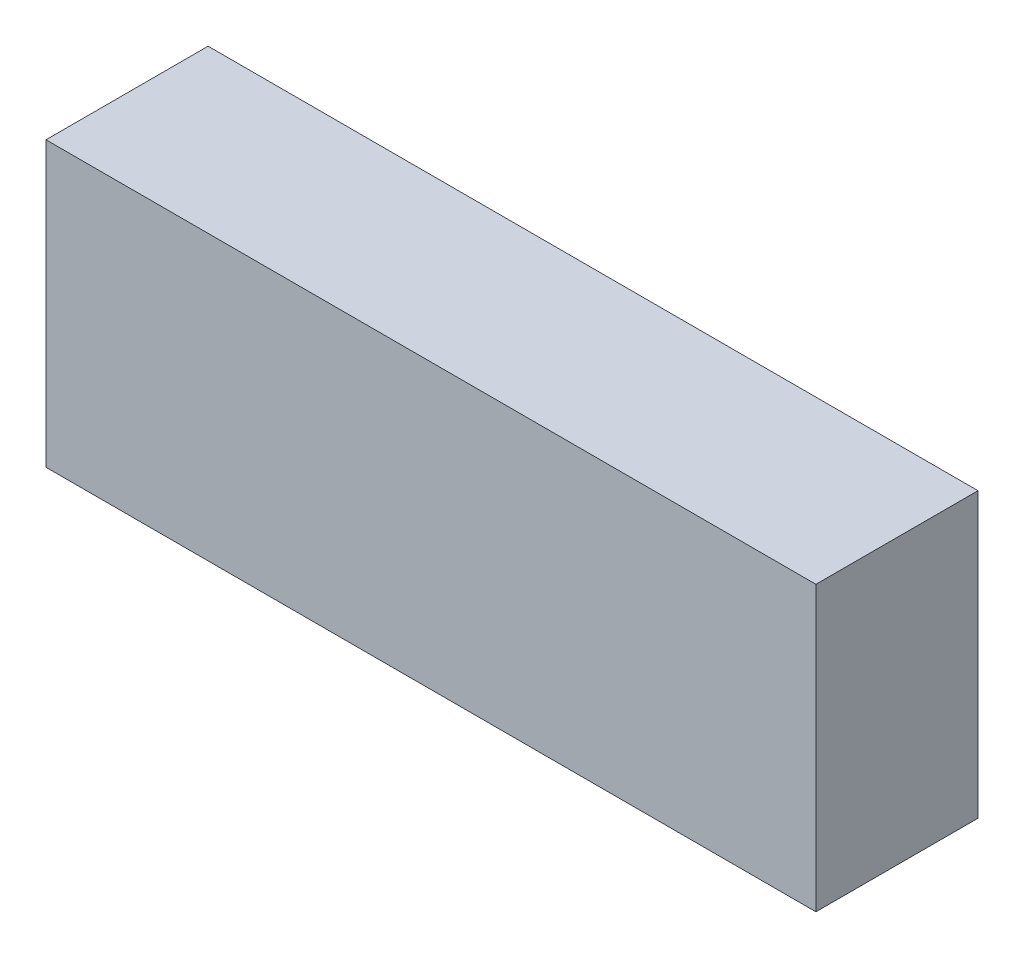
ISO-10303-21;
HEADER;
FILE_DESCRIPTION(('STEP AP214'),'2;1');
FILE_NAME('part.step','',(''),(''),'','','');
FILE_SCHEMA(('AUTOMOTIVE_DESIGN { 1 0 10303 214 1 1 1 1 }'));
ENDSEC;
DATA;
#1=APPLICATION_CONTEXT('core data for automotive mechanical design processes');
#2=APPLICATION_PROTOCOL_DEFINITION('international standard','automotive_design',2000,#1);
#3=PRODUCT_CONTEXT('',#1,'mechanical');
#4=PRODUCT('Part','Part','',(#3));
#5=PRODUCT_RELATED_PRODUCT_CATEGORY('part','',(#4));
#6=PRODUCT_DEFINITION_FORMATION('','',#4);
#7=PRODUCT_DEFINITION_CONTEXT('part definition',#1,'design');
#8=PRODUCT_DEFINITION('design','',#6,#7);
#9=PRODUCT_DEFINITION_SHAPE('','',#8);
#10=(LENGTH_UNIT() NAMED_UNIT(*) SI_UNIT(.MILLI.,.METRE.));
#11=(NAMED_UNIT(*) PLANE_ANGLE_UNIT() SI_UNIT($,.RADIAN.));
#12=(NAMED_UNIT(*) SI_UNIT($,.STERADIAN.) SOLID_ANGLE_UNIT());
#13=UNCERTAINTY_MEASURE_WITH_UNIT(LENGTH_MEASURE(1.E-05),#10,'distance_accuracy_value','');
#14=(GEOMETRIC_REPRESENTATION_CONTEXT(3) GLOBAL_UNCERTAINTY_ASSIGNED_CONTEXT((#13)) GLOBAL_UNIT_ASSIGNED_CONTEXT((#10,
#11,#12)) REPRESENTATION_CONTEXT('',''));
#15=CARTESIAN_POINT('',(0.,0.,0.));
#16=DIRECTION('',(0.,0.,1.));
#17=DIRECTION('',(1.,0.,0.));
#18=AXIS2_PLACEMENT_3D('',#15,#16,#17);
#19=CARTESIAN_POINT('',(19.,-7.,8.));
#20=DIRECTION('',(-1.,0.,0.));
#21=DIRECTION('',(0.,0.,1.));
#22=AXIS2_PLACEMENT_3D('',#19,#20,#21);
#23=PLANE('',#22);
#24=DIRECTION('',(0.,1.,0.));
#25=VECTOR('',#24,1.);
#26=CARTESIAN_POINT('',(19.,-7.,0.));
#27=LINE('',#26,#25);
#28=CARTESIAN_POINT('',(19.,-7.,0.));
#29=VERTEX_POINT('',#28);
#30=CARTESIAN_POINT('',(19.,7.,0.));
#31=VERTEX_POINT('',#30);
#32=EDGE_CURVE('E97',#29,#31,#27,.T.);
#33=ORIENTED_EDGE('',*,*,#32,.T.);
#34=DIRECTION('',(0.,0.,-1.));
#35=VECTOR('',#34,1.);
#36=CARTESIAN_POINT('',(19.,7.,8.));
#37=LINE('',#36,#35);
#38=CARTESIAN_POINT('',(19.,7.,8.));
#39=VERTEX_POINT('',#38);
#40=EDGE_CURVE('E11',#39,#31,#37,.T.);
#41=ORIENTED_EDGE('',*,*,#40,.F.);
#42=DIRECTION('',(0.,1.,0.));
#43=VECTOR('',#42,1.);
#44=CARTESIAN_POINT('',(19.,-7.,8.));
#45=LINE('',#44,#43);
#46=CARTESIAN_POINT('',(19.,-7.,8.));
#47=VERTEX_POINT('',#46);
#48=EDGE_CURVE('E85',#47,#39,#45,.T.);
#49=ORIENTED_EDGE('',*,*,#48,.F.);
#50=DIRECTION('',(0.,0.,-1.));
#51=VECTOR('',#50,1.);
#52=CARTESIAN_POINT('',(19.,-7.,8.));
#53=LINE('',#52,#51);
#54=EDGE_CURVE('E93',#47,#29,#53,.T.);
#55=ORIENTED_EDGE('',*,*,#54,.T.);
#56=EDGE_LOOP('',(#33,#41,#49,#55));
#57=FACE_BOUND('',#56,.T.);
#58=ADVANCED_FACE('F34',(#57),#23,.F.);
#59=CARTESIAN_POINT('',(-19.,7.,8.));
#60=DIRECTION('',(0.,-1.,0.));
#61=DIRECTION('',(0.,0.,-1.));
#62=AXIS2_PLACEMENT_3D('',#59,#60,#61);
#63=PLANE('',#62);
#64=DIRECTION('',(-1.,0.,0.));
#65=VECTOR('',#64,1.);
#66=CARTESIAN_POINT('',(-19.,7.,0.));
#67=LINE('',#66,#65);
#68=CARTESIAN_POINT('',(-19.,7.,0.));
#69=VERTEX_POINT('',#68);
#70=EDGE_CURVE('E89',#31,#69,#67,.T.);
#71=ORIENTED_EDGE('',*,*,#70,.T.);
#72=DIRECTION('',(0.,0.,-1.));
#73=VECTOR('',#72,1.);
#74=CARTESIAN_POINT('',(-19.,7.,8.));
#75=LINE('',#74,#73);
#76=CARTESIAN_POINT('',(-19.,7.,8.));
#77=VERTEX_POINT('',#76);
#78=EDGE_CURVE('E42',#77,#69,#75,.T.);
#79=ORIENTED_EDGE('',*,*,#78,.F.);
#80=DIRECTION('',(-1.,0.,0.));
#81=VECTOR('',#80,1.);
#82=CARTESIAN_POINT('',(-19.,7.,8.));
#83=LINE('',#82,#81);
#84=EDGE_CURVE('E80',#39,#77,#83,.T.);
#85=ORIENTED_EDGE('',*,*,#84,.F.);
#86=ORIENTED_EDGE('',*,*,#40,.T.);
#87=EDGE_LOOP('',(#71,#79,#85,#86));
#88=FACE_BOUND('',#87,.T.);
#89=ADVANCED_FACE('F88',(#88),#63,.F.);
#90=CARTESIAN_POINT('',(-19.,-7.,8.));
#91=DIRECTION('',(1.,0.,0.));
#92=DIRECTION('',(0.,0.,-1.));
#93=AXIS2_PLACEMENT_3D('',#90,#91,#92);
#94=PLANE('',#93);
#95=DIRECTION('',(0.,-1.,0.));
#96=VECTOR('',#95,1.);
#97=CARTESIAN_POINT('',(-19.,-7.,0.));
#98=LINE('',#97,#96);
#99=CARTESIAN_POINT('',(-19.,-7.,0.));
#100=VERTEX_POINT('',#99);
#101=EDGE_CURVE('E67',#69,#100,#98,.T.);
#102=ORIENTED_EDGE('',*,*,#101,.T.);
#103=DIRECTION('',(0.,0.,-1.));
#104=VECTOR('',#103,1.);
#105=CARTESIAN_POINT('',(-19.,-7.,8.));
#106=LINE('',#105,#104);
#107=CARTESIAN_POINT('',(-19.,-7.,8.));
#108=VERTEX_POINT('',#107);
#109=EDGE_CURVE('E90',#108,#100,#106,.T.);
#110=ORIENTED_EDGE('',*,*,#109,.F.);
#111=DIRECTION('',(0.,-1.,0.));
#112=VECTOR('',#111,1.);
#113=CARTESIAN_POINT('',(-19.,-7.,8.));
#114=LINE('',#113,#112);
#115=EDGE_CURVE('E83',#77,#108,#114,.T.);
#116=ORIENTED_EDGE('',*,*,#115,.F.);
#117=ORIENTED_EDGE('',*,*,#78,.T.);
#118=EDGE_LOOP('',(#102,#110,#116,#117));
#119=FACE_BOUND('',#118,.T.);
#120=ADVANCED_FACE('F91',(#119),#94,.F.);
#121=CARTESIAN_POINT('',(-19.,-7.,8.));
#122=DIRECTION('',(0.,1.,0.));
#123=DIRECTION('',(0.,0.,1.));
#124=AXIS2_PLACEMENT_3D('',#121,#122,#123);
#125=PLANE('',#124);
#126=DIRECTION('',(1.,0.,0.));
#127=VECTOR('',#126,1.);
#128=CARTESIAN_POINT('',(-19.,-7.,0.));
#129=LINE('',#128,#127);
#130=EDGE_CURVE('E73',#100,#29,#129,.T.);
#131=ORIENTED_EDGE('',*,*,#130,.T.);
#132=ORIENTED_EDGE('',*,*,#54,.F.);
#133=DIRECTION('',(1.,0.,0.));
#134=VECTOR('',#133,1.);
#135=CARTESIAN_POINT('',(-19.,-7.,8.));
#136=LINE('',#135,#134);
#137=EDGE_CURVE('E50',#108,#47,#136,.T.);
#138=ORIENTED_EDGE('',*,*,#137,.F.);
#139=ORIENTED_EDGE('',*,*,#109,.T.);
#140=EDGE_LOOP('',(#131,#132,#138,#139));
#141=FACE_BOUND('',#140,.T.);
#142=ADVANCED_FACE('F104',(#141),#125,.F.);
#143=CARTESIAN_POINT('',(0.,0.,8.));
#144=DIRECTION('',(0.,0.,-1.));
#145=DIRECTION('',(-1.,0.,0.));
#146=AXIS2_PLACEMENT_3D('',#143,#144,#145);
#147=PLANE('',#146);
#148=ORIENTED_EDGE('',*,*,#48,.T.);
#149=ORIENTED_EDGE('',*,*,#84,.T.);
#150=ORIENTED_EDGE('',*,*,#115,.T.);
#151=ORIENTED_EDGE('',*,*,#137,.T.);
#152=EDGE_LOOP('',(#148,#149,#150,#151));
#153=FACE_BOUND('',#152,.T.);
#154=ADVANCED_FACE('F81',(#153),#147,.F.);
#155=CARTESIAN_POINT('',(0.,0.,0.));
#156=DIRECTION('',(0.,0.,-1.));
#157=DIRECTION('',(-1.,0.,0.));
#158=AXIS2_PLACEMENT_3D('',#155,#156,#157);
#159=PLANE('',#158);
#160=ORIENTED_EDGE('',*,*,#32,.F.);
#161=ORIENTED_EDGE('',*,*,#130,.F.);
#162=ORIENTED_EDGE('',*,*,#101,.F.);
#163=ORIENTED_EDGE('',*,*,#70,.F.);
#164=EDGE_LOOP('',(#160,#161,#162,#163));
#165=FACE_BOUND('',#164,.T.);
#166=ADVANCED_FACE('F107',(#165),#159,.T.);
#167=CLOSED_SHELL('',(#58,#89,#120,#142,#154,#166));
#168=MANIFOLD_SOLID_BREP('B2',#167);
#169=ADVANCED_BREP_SHAPE_REPRESENTATION('',(#18,#168),#14);
#170=SHAPE_DEFINITION_REPRESENTATION(#9,#169);
ENDSEC;
END-ISO-10303-21;
